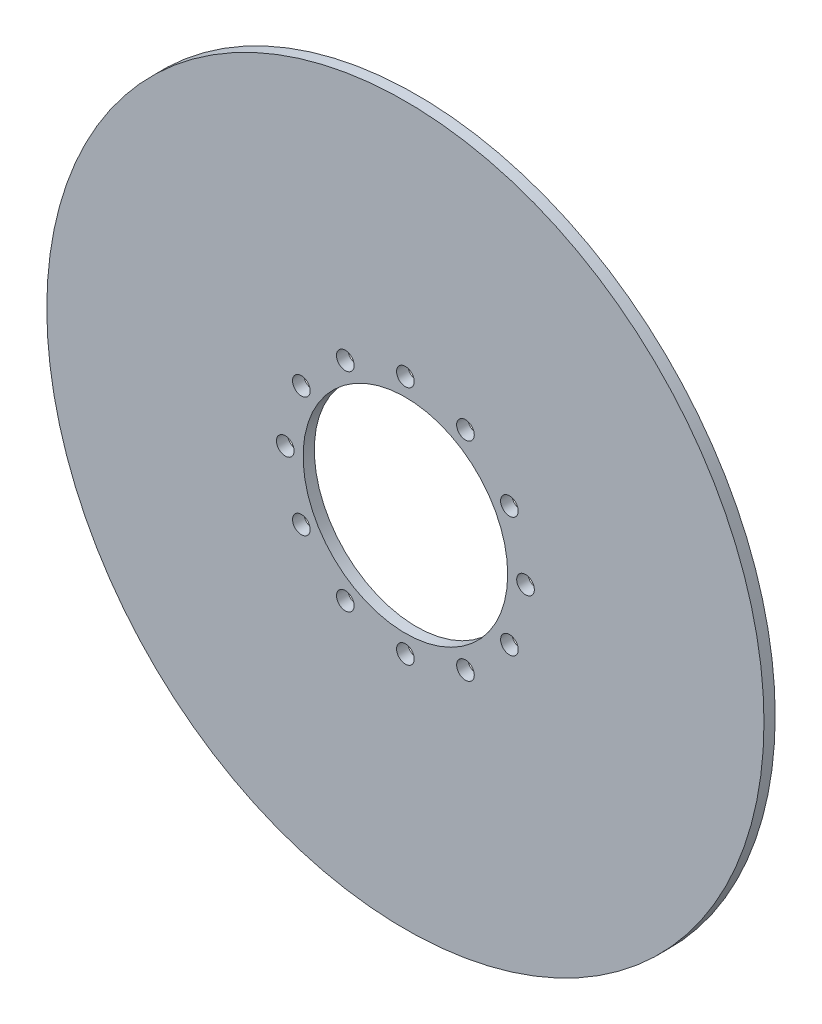
ISO-10303-21;
HEADER;
FILE_DESCRIPTION(('STEP AP214'),'2;1');
FILE_NAME('part.step','',(''),(''),'','','');
FILE_SCHEMA(('AUTOMOTIVE_DESIGN { 1 0 10303 214 1 1 1 1 }'));
ENDSEC;
DATA;
#1=APPLICATION_CONTEXT('core data for automotive mechanical design processes');
#2=APPLICATION_PROTOCOL_DEFINITION('international standard','automotive_design',2000,#1);
#3=PRODUCT_CONTEXT('',#1,'mechanical');
#4=PRODUCT('Part','Part','',(#3));
#5=PRODUCT_RELATED_PRODUCT_CATEGORY('part','',(#4));
#6=PRODUCT_DEFINITION_FORMATION('','',#4);
#7=PRODUCT_DEFINITION_CONTEXT('part definition',#1,'design');
#8=PRODUCT_DEFINITION('design','',#6,#7);
#9=PRODUCT_DEFINITION_SHAPE('','',#8);
#10=(LENGTH_UNIT() NAMED_UNIT(*) SI_UNIT(.MILLI.,.METRE.));
#11=(NAMED_UNIT(*) PLANE_ANGLE_UNIT() SI_UNIT($,.RADIAN.));
#12=(NAMED_UNIT(*) SI_UNIT($,.STERADIAN.) SOLID_ANGLE_UNIT());
#13=UNCERTAINTY_MEASURE_WITH_UNIT(LENGTH_MEASURE(1.E-05),#10,'distance_accuracy_value','');
#14=(GEOMETRIC_REPRESENTATION_CONTEXT(3) GLOBAL_UNCERTAINTY_ASSIGNED_CONTEXT((#13)) GLOBAL_UNIT_ASSIGNED_CONTEXT((#10,
#11,#12)) REPRESENTATION_CONTEXT('',''));
#15=CARTESIAN_POINT('',(0.,0.,0.));
#16=DIRECTION('',(0.,0.,1.));
#17=DIRECTION('',(1.,0.,0.));
#18=AXIS2_PLACEMENT_3D('',#15,#16,#17);
#19=CARTESIAN_POINT('',(0.,0.,3.175));
#20=DIRECTION('',(0.,0.,1.));
#21=DIRECTION('',(1.,0.,0.));
#22=AXIS2_PLACEMENT_3D('',#19,#20,#21);
#23=PLANE('',#22);
#24=CARTESIAN_POINT('',(-29.4448637286702,16.9999999999987,3.175));
#25=DIRECTION('',(0.,0.,1.));
#26=DIRECTION('',(1.,0.,0.));
#27=AXIS2_PLACEMENT_3D('',#24,#25,#26);
#28=CIRCLE('',#27,2.49698906987796);
#29=CARTESIAN_POINT('',(-26.9478746587923,16.9999999999987,3.175));
#30=VERTEX_POINT('',#29);
#31=EDGE_CURVE('E108',#30,#30,#28,.T.);
#32=ORIENTED_EDGE('',*,*,#31,.F.);
#33=EDGE_LOOP('',(#32));
#34=FACE_BOUND('',#33,.T.);
#35=CARTESIAN_POINT('',(-29.4448637286688,-17.0000000000013,3.175));
#36=DIRECTION('',(0.,0.,1.));
#37=DIRECTION('',(1.,0.,0.));
#38=AXIS2_PLACEMENT_3D('',#35,#36,#37);
#39=CIRCLE('',#38,2.49698906987796);
#40=CARTESIAN_POINT('',(-26.9478746587908,-17.0000000000013,3.175));
#41=VERTEX_POINT('',#40);
#42=EDGE_CURVE('E96',#41,#41,#39,.T.);
#43=ORIENTED_EDGE('',*,*,#42,.F.);
#44=EDGE_LOOP('',(#43));
#45=FACE_BOUND('',#44,.T.);
#46=CARTESIAN_POINT('',(2.86804195578331E-12,-34.,3.175));
#47=DIRECTION('',(0.,0.,1.));
#48=DIRECTION('',(1.,0.,0.));
#49=AXIS2_PLACEMENT_3D('',#46,#47,#48);
#50=CIRCLE('',#49,2.49698906987796);
#51=CARTESIAN_POINT('',(2.49698906988083,-34.,3.175));
#52=VERTEX_POINT('',#51);
#53=EDGE_CURVE('E84',#52,#52,#50,.T.);
#54=ORIENTED_EDGE('',*,*,#53,.F.);
#55=EDGE_LOOP('',(#54));
#56=FACE_BOUND('',#55,.T.);
#57=CARTESIAN_POINT('',(29.4448637286731,-16.9999999999988,3.175));
#58=DIRECTION('',(0.,0.,1.));
#59=DIRECTION('',(1.,0.,0.));
#60=AXIS2_PLACEMENT_3D('',#57,#58,#59);
#61=CIRCLE('',#60,2.49698906987769);
#62=CARTESIAN_POINT('',(31.9418527985508,-16.9999999999988,3.175));
#63=VERTEX_POINT('',#62);
#64=EDGE_CURVE('E72',#63,#63,#61,.T.);
#65=ORIENTED_EDGE('',*,*,#64,.F.);
#66=EDGE_LOOP('',(#65));
#67=FACE_BOUND('',#66,.T.);
#68=CARTESIAN_POINT('',(29.4448637286716,17.0000000000012,3.175));
#69=DIRECTION('',(0.,0.,1.));
#70=DIRECTION('',(1.,0.,0.));
#71=AXIS2_PLACEMENT_3D('',#68,#69,#70);
#72=CIRCLE('',#71,2.49698906987796);
#73=CARTESIAN_POINT('',(31.9418527985496,17.0000000000012,3.175));
#74=VERTEX_POINT('',#73);
#75=EDGE_CURVE('E60',#74,#74,#72,.T.);
#76=ORIENTED_EDGE('',*,*,#75,.F.);
#77=EDGE_LOOP('',(#76));
#78=FACE_BOUND('',#77,.T.);
#79=CARTESIAN_POINT('',(0.,34.,3.175));
#80=DIRECTION('',(0.,0.,1.));
#81=DIRECTION('',(1.,0.,0.));
#82=AXIS2_PLACEMENT_3D('',#79,#80,#81);
#83=CIRCLE('',#82,2.49698906987796);
#84=CARTESIAN_POINT('',(2.49698906987796,34.,3.175));
#85=VERTEX_POINT('',#84);
#86=EDGE_CURVE('E48',#85,#85,#83,.T.);
#87=ORIENTED_EDGE('',*,*,#86,.F.);
#88=EDGE_LOOP('',(#87));
#89=FACE_BOUND('',#88,.T.);
#90=CARTESIAN_POINT('',(0.,0.,3.175));
#91=DIRECTION('',(0.,0.,1.));
#92=DIRECTION('',(1.,0.,0.));
#93=AXIS2_PLACEMENT_3D('',#90,#91,#92);
#94=CIRCLE('',#93,101.5);
#95=CARTESIAN_POINT('',(101.5,0.,3.175));
#96=VERTEX_POINT('',#95);
#97=EDGE_CURVE('E10',#96,#96,#94,.T.);
#98=ORIENTED_EDGE('',*,*,#97,.T.);
#99=EDGE_LOOP('',(#98));
#100=FACE_BOUND('',#99,.T.);
#101=CARTESIAN_POINT('',(0.,0.,3.175));
#102=DIRECTION('',(0.,0.,1.));
#103=DIRECTION('',(1.,0.,0.));
#104=AXIS2_PLACEMENT_3D('',#101,#102,#103);
#105=CIRCLE('',#104,28.956);
#106=CARTESIAN_POINT('',(28.956,0.,3.175));
#107=VERTEX_POINT('',#106);
#108=EDGE_CURVE('E43',#107,#107,#105,.T.);
#109=ORIENTED_EDGE('',*,*,#108,.F.);
#110=EDGE_LOOP('',(#109));
#111=FACE_BOUND('',#110,.T.);
#112=CARTESIAN_POINT('',(17.0000000000002,29.4448637286716,3.175));
#113=DIRECTION('',(0.,0.,1.));
#114=DIRECTION('',(1.,0.,0.));
#115=AXIS2_PLACEMENT_3D('',#112,#113,#114);
#116=CIRCLE('',#115,2.49698906987796);
#117=CARTESIAN_POINT('',(19.4969890698782,29.4448637286716,3.175));
#118=VERTEX_POINT('',#117);
#119=EDGE_CURVE('E54',#118,#118,#116,.T.);
#120=ORIENTED_EDGE('',*,*,#119,.F.);
#121=EDGE_LOOP('',(#120));
#122=FACE_BOUND('',#121,.T.);
#123=CARTESIAN_POINT('',(34.0000000000014,1.43402097789165E-12,3.175));
#124=DIRECTION('',(0.,0.,1.));
#125=DIRECTION('',(1.,0.,0.));
#126=AXIS2_PLACEMENT_3D('',#123,#124,#125);
#127=CIRCLE('',#126,2.49698906987796);
#128=CARTESIAN_POINT('',(36.4969890698794,1.43402097789165E-12,3.175));
#129=VERTEX_POINT('',#128);
#130=EDGE_CURVE('E66',#129,#129,#127,.T.);
#131=ORIENTED_EDGE('',*,*,#130,.F.);
#132=EDGE_LOOP('',(#131));
#133=FACE_BOUND('',#132,.T.);
#134=CARTESIAN_POINT('',(17.0000000000027,-29.4448637286702,3.175));
#135=DIRECTION('',(0.,0.,1.));
#136=DIRECTION('',(1.,0.,0.));
#137=AXIS2_PLACEMENT_3D('',#134,#135,#136);
#138=CIRCLE('',#137,2.49698906987837);
#139=CARTESIAN_POINT('',(19.4969890698811,-29.4448637286702,3.175));
#140=VERTEX_POINT('',#139);
#141=EDGE_CURVE('E78',#140,#140,#138,.T.);
#142=ORIENTED_EDGE('',*,*,#141,.F.);
#143=EDGE_LOOP('',(#142));
#144=FACE_BOUND('',#143,.T.);
#145=CARTESIAN_POINT('',(-16.9999999999973,-29.4448637286716,3.175));
#146=DIRECTION('',(0.,0.,1.));
#147=DIRECTION('',(1.,0.,0.));
#148=AXIS2_PLACEMENT_3D('',#145,#146,#147);
#149=CIRCLE('',#148,2.49698906987796);
#150=CARTESIAN_POINT('',(-14.5030109301194,-29.4448637286716,3.175));
#151=VERTEX_POINT('',#150);
#152=EDGE_CURVE('E90',#151,#151,#149,.T.);
#153=ORIENTED_EDGE('',*,*,#152,.F.);
#154=EDGE_LOOP('',(#153));
#155=FACE_BOUND('',#154,.T.);
#156=CARTESIAN_POINT('',(-33.9999999999986,-1.43818477700875E-12,3.175));
#157=DIRECTION('',(0.,0.,1.));
#158=DIRECTION('',(1.,0.,0.));
#159=AXIS2_PLACEMENT_3D('',#156,#157,#158);
#160=CIRCLE('',#159,2.49698906987796);
#161=CARTESIAN_POINT('',(-31.5030109301206,-1.43818477700875E-12,3.175));
#162=VERTEX_POINT('',#161);
#163=EDGE_CURVE('E102',#162,#162,#160,.T.);
#164=ORIENTED_EDGE('',*,*,#163,.F.);
#165=EDGE_LOOP('',(#164));
#166=FACE_BOUND('',#165,.T.);
#167=CARTESIAN_POINT('',(-16.9999999999998,29.4448637286702,3.175));
#168=DIRECTION('',(0.,0.,1.));
#169=DIRECTION('',(1.,0.,0.));
#170=AXIS2_PLACEMENT_3D('',#167,#168,#169);
#171=CIRCLE('',#170,2.49698906987796);
#172=CARTESIAN_POINT('',(-14.5030109301219,29.4448637286702,3.175));
#173=VERTEX_POINT('',#172);
#174=EDGE_CURVE('E114',#173,#173,#171,.T.);
#175=ORIENTED_EDGE('',*,*,#174,.F.);
#176=EDGE_LOOP('',(#175));
#177=FACE_BOUND('',#176,.T.);
#178=ADVANCED_FACE('F32',(#34,#45,#56,#67,#78,#89,#100,#111,#122,#133,#144,#155,#166,#177),#23,.T.);
#179=CARTESIAN_POINT('',(0.,0.,0.));
#180=DIRECTION('',(0.,0.,1.));
#181=DIRECTION('',(1.,0.,0.));
#182=AXIS2_PLACEMENT_3D('',#179,#180,#181);
#183=PLANE('',#182);
#184=CARTESIAN_POINT('',(0.,0.,0.));
#185=DIRECTION('',(0.,0.,1.));
#186=DIRECTION('',(1.,0.,0.));
#187=AXIS2_PLACEMENT_3D('',#184,#185,#186);
#188=CIRCLE('',#187,101.5);
#189=CARTESIAN_POINT('',(101.5,0.,0.));
#190=VERTEX_POINT('',#189);
#191=EDGE_CURVE('E36',#190,#190,#188,.T.);
#192=ORIENTED_EDGE('',*,*,#191,.F.);
#193=EDGE_LOOP('',(#192));
#194=FACE_BOUND('',#193,.T.);
#195=CARTESIAN_POINT('',(0.,0.,0.));
#196=DIRECTION('',(0.,0.,1.));
#197=DIRECTION('',(1.,0.,0.));
#198=AXIS2_PLACEMENT_3D('',#195,#196,#197);
#199=CIRCLE('',#198,28.956);
#200=CARTESIAN_POINT('',(28.956,0.,0.));
#201=VERTEX_POINT('',#200);
#202=EDGE_CURVE('E45',#201,#201,#199,.T.);
#203=ORIENTED_EDGE('',*,*,#202,.T.);
#204=EDGE_LOOP('',(#203));
#205=FACE_BOUND('',#204,.T.);
#206=CARTESIAN_POINT('',(0.,34.,0.));
#207=DIRECTION('',(0.,0.,1.));
#208=DIRECTION('',(1.,0.,0.));
#209=AXIS2_PLACEMENT_3D('',#206,#207,#208);
#210=CIRCLE('',#209,2.49698906987796);
#211=CARTESIAN_POINT('',(2.49698906987796,34.,0.));
#212=VERTEX_POINT('',#211);
#213=EDGE_CURVE('E51',#212,#212,#210,.T.);
#214=ORIENTED_EDGE('',*,*,#213,.T.);
#215=EDGE_LOOP('',(#214));
#216=FACE_BOUND('',#215,.T.);
#217=CARTESIAN_POINT('',(17.0000000000002,29.4448637286716,0.));
#218=DIRECTION('',(0.,0.,1.));
#219=DIRECTION('',(1.,0.,0.));
#220=AXIS2_PLACEMENT_3D('',#217,#218,#219);
#221=CIRCLE('',#220,2.49698906987796);
#222=CARTESIAN_POINT('',(19.4969890698782,29.4448637286716,0.));
#223=VERTEX_POINT('',#222);
#224=EDGE_CURVE('E57',#223,#223,#221,.T.);
#225=ORIENTED_EDGE('',*,*,#224,.T.);
#226=EDGE_LOOP('',(#225));
#227=FACE_BOUND('',#226,.T.);
#228=CARTESIAN_POINT('',(29.4448637286716,17.0000000000012,0.));
#229=DIRECTION('',(0.,0.,1.));
#230=DIRECTION('',(1.,0.,0.));
#231=AXIS2_PLACEMENT_3D('',#228,#229,#230);
#232=CIRCLE('',#231,2.49698906987796);
#233=CARTESIAN_POINT('',(31.9418527985496,17.0000000000012,0.));
#234=VERTEX_POINT('',#233);
#235=EDGE_CURVE('E63',#234,#234,#232,.T.);
#236=ORIENTED_EDGE('',*,*,#235,.T.);
#237=EDGE_LOOP('',(#236));
#238=FACE_BOUND('',#237,.T.);
#239=CARTESIAN_POINT('',(34.0000000000014,1.43402097789165E-12,0.));
#240=DIRECTION('',(0.,0.,1.));
#241=DIRECTION('',(1.,0.,0.));
#242=AXIS2_PLACEMENT_3D('',#239,#240,#241);
#243=CIRCLE('',#242,2.49698906987796);
#244=CARTESIAN_POINT('',(36.4969890698794,1.43402097789165E-12,0.));
#245=VERTEX_POINT('',#244);
#246=EDGE_CURVE('E69',#245,#245,#243,.T.);
#247=ORIENTED_EDGE('',*,*,#246,.T.);
#248=EDGE_LOOP('',(#247));
#249=FACE_BOUND('',#248,.T.);
#250=CARTESIAN_POINT('',(29.4448637286731,-16.9999999999988,0.));
#251=DIRECTION('',(0.,0.,1.));
#252=DIRECTION('',(1.,0.,0.));
#253=AXIS2_PLACEMENT_3D('',#250,#251,#252);
#254=CIRCLE('',#253,2.49698906987769);
#255=CARTESIAN_POINT('',(31.9418527985508,-16.9999999999988,0.));
#256=VERTEX_POINT('',#255);
#257=EDGE_CURVE('E75',#256,#256,#254,.T.);
#258=ORIENTED_EDGE('',*,*,#257,.T.);
#259=EDGE_LOOP('',(#258));
#260=FACE_BOUND('',#259,.T.);
#261=CARTESIAN_POINT('',(17.0000000000027,-29.4448637286702,0.));
#262=DIRECTION('',(0.,0.,1.));
#263=DIRECTION('',(1.,0.,0.));
#264=AXIS2_PLACEMENT_3D('',#261,#262,#263);
#265=CIRCLE('',#264,2.49698906987837);
#266=CARTESIAN_POINT('',(19.4969890698811,-29.4448637286702,0.));
#267=VERTEX_POINT('',#266);
#268=EDGE_CURVE('E81',#267,#267,#265,.T.);
#269=ORIENTED_EDGE('',*,*,#268,.T.);
#270=EDGE_LOOP('',(#269));
#271=FACE_BOUND('',#270,.T.);
#272=CARTESIAN_POINT('',(2.86804195578331E-12,-34.,0.));
#273=DIRECTION('',(0.,0.,1.));
#274=DIRECTION('',(1.,0.,0.));
#275=AXIS2_PLACEMENT_3D('',#272,#273,#274);
#276=CIRCLE('',#275,2.49698906987796);
#277=CARTESIAN_POINT('',(2.49698906988083,-34.,0.));
#278=VERTEX_POINT('',#277);
#279=EDGE_CURVE('E87',#278,#278,#276,.T.);
#280=ORIENTED_EDGE('',*,*,#279,.T.);
#281=EDGE_LOOP('',(#280));
#282=FACE_BOUND('',#281,.T.);
#283=CARTESIAN_POINT('',(-16.9999999999973,-29.4448637286716,0.));
#284=DIRECTION('',(0.,0.,1.));
#285=DIRECTION('',(1.,0.,0.));
#286=AXIS2_PLACEMENT_3D('',#283,#284,#285);
#287=CIRCLE('',#286,2.49698906987796);
#288=CARTESIAN_POINT('',(-14.5030109301194,-29.4448637286716,0.));
#289=VERTEX_POINT('',#288);
#290=EDGE_CURVE('E93',#289,#289,#287,.T.);
#291=ORIENTED_EDGE('',*,*,#290,.T.);
#292=EDGE_LOOP('',(#291));
#293=FACE_BOUND('',#292,.T.);
#294=CARTESIAN_POINT('',(-29.4448637286688,-17.0000000000013,0.));
#295=DIRECTION('',(0.,0.,1.));
#296=DIRECTION('',(1.,0.,0.));
#297=AXIS2_PLACEMENT_3D('',#294,#295,#296);
#298=CIRCLE('',#297,2.49698906987796);
#299=CARTESIAN_POINT('',(-26.9478746587908,-17.0000000000013,0.));
#300=VERTEX_POINT('',#299);
#301=EDGE_CURVE('E99',#300,#300,#298,.T.);
#302=ORIENTED_EDGE('',*,*,#301,.T.);
#303=EDGE_LOOP('',(#302));
#304=FACE_BOUND('',#303,.T.);
#305=CARTESIAN_POINT('',(-33.9999999999986,-1.43818477700875E-12,0.));
#306=DIRECTION('',(0.,0.,1.));
#307=DIRECTION('',(1.,0.,0.));
#308=AXIS2_PLACEMENT_3D('',#305,#306,#307);
#309=CIRCLE('',#308,2.49698906987796);
#310=CARTESIAN_POINT('',(-31.5030109301206,-1.43818477700875E-12,0.));
#311=VERTEX_POINT('',#310);
#312=EDGE_CURVE('E105',#311,#311,#309,.T.);
#313=ORIENTED_EDGE('',*,*,#312,.T.);
#314=EDGE_LOOP('',(#313));
#315=FACE_BOUND('',#314,.T.);
#316=CARTESIAN_POINT('',(-29.4448637286702,16.9999999999987,0.));
#317=DIRECTION('',(0.,0.,1.));
#318=DIRECTION('',(1.,0.,0.));
#319=AXIS2_PLACEMENT_3D('',#316,#317,#318);
#320=CIRCLE('',#319,2.49698906987796);
#321=CARTESIAN_POINT('',(-26.9478746587923,16.9999999999987,0.));
#322=VERTEX_POINT('',#321);
#323=EDGE_CURVE('E111',#322,#322,#320,.T.);
#324=ORIENTED_EDGE('',*,*,#323,.T.);
#325=EDGE_LOOP('',(#324));
#326=FACE_BOUND('',#325,.T.);
#327=CARTESIAN_POINT('',(-16.9999999999998,29.4448637286702,0.));
#328=DIRECTION('',(0.,0.,1.));
#329=DIRECTION('',(1.,0.,0.));
#330=AXIS2_PLACEMENT_3D('',#327,#328,#329);
#331=CIRCLE('',#330,2.49698906987796);
#332=CARTESIAN_POINT('',(-14.5030109301219,29.4448637286702,0.));
#333=VERTEX_POINT('',#332);
#334=EDGE_CURVE('E117',#333,#333,#331,.T.);
#335=ORIENTED_EDGE('',*,*,#334,.T.);
#336=EDGE_LOOP('',(#335));
#337=FACE_BOUND('',#336,.T.);
#338=ADVANCED_FACE('F127',(#194,#205,#216,#227,#238,#249,#260,#271,#282,#293,#304,#315,#326,
#337),#183,.F.);
#339=CARTESIAN_POINT('',(0.,0.,3.175));
#340=DIRECTION('',(0.,0.,-1.));
#341=DIRECTION('',(-1.,0.,0.));
#342=AXIS2_PLACEMENT_3D('',#339,#340,#341);
#343=CYLINDRICAL_SURFACE('',#342,101.5);
#344=ORIENTED_EDGE('',*,*,#97,.F.);
#345=EDGE_LOOP('',(#344));
#346=FACE_BOUND('',#345,.T.);
#347=ORIENTED_EDGE('',*,*,#191,.T.);
#348=EDGE_LOOP('',(#347));
#349=FACE_BOUND('',#348,.T.);
#350=ADVANCED_FACE('F34',(#346,#349),#343,.T.);
#351=CARTESIAN_POINT('',(0.,0.,3.175));
#352=DIRECTION('',(0.,0.,-1.));
#353=DIRECTION('',(-1.,0.,0.));
#354=AXIS2_PLACEMENT_3D('',#351,#352,#353);
#355=CYLINDRICAL_SURFACE('',#354,28.956);
#356=ORIENTED_EDGE('',*,*,#108,.T.);
#357=EDGE_LOOP('',(#356));
#358=FACE_BOUND('',#357,.T.);
#359=ORIENTED_EDGE('',*,*,#202,.F.);
#360=EDGE_LOOP('',(#359));
#361=FACE_BOUND('',#360,.T.);
#362=ADVANCED_FACE('F137',(#358,#361),#355,.F.);
#363=CARTESIAN_POINT('',(0.,34.,3.175));
#364=DIRECTION('',(0.,0.,-1.));
#365=DIRECTION('',(-1.,0.,0.));
#366=AXIS2_PLACEMENT_3D('',#363,#364,#365);
#367=CYLINDRICAL_SURFACE('',#366,2.49698906987796);
#368=ORIENTED_EDGE('',*,*,#86,.T.);
#369=EDGE_LOOP('',(#368));
#370=FACE_BOUND('',#369,.T.);
#371=ORIENTED_EDGE('',*,*,#213,.F.);
#372=EDGE_LOOP('',(#371));
#373=FACE_BOUND('',#372,.T.);
#374=ADVANCED_FACE('F140',(#370,#373),#367,.F.);
#375=CARTESIAN_POINT('',(17.0000000000002,29.4448637286716,3.175));
#376=DIRECTION('',(0.,0.,-1.));
#377=DIRECTION('',(-1.,0.,0.));
#378=AXIS2_PLACEMENT_3D('',#375,#376,#377);
#379=CYLINDRICAL_SURFACE('',#378,2.49698906987796);
#380=ORIENTED_EDGE('',*,*,#119,.T.);
#381=EDGE_LOOP('',(#380));
#382=FACE_BOUND('',#381,.T.);
#383=ORIENTED_EDGE('',*,*,#224,.F.);
#384=EDGE_LOOP('',(#383));
#385=FACE_BOUND('',#384,.T.);
#386=ADVANCED_FACE('F144',(#382,#385),#379,.F.);
#387=CARTESIAN_POINT('',(29.4448637286716,17.0000000000012,3.175));
#388=DIRECTION('',(0.,0.,-1.));
#389=DIRECTION('',(-1.,0.,0.));
#390=AXIS2_PLACEMENT_3D('',#387,#388,#389);
#391=CYLINDRICAL_SURFACE('',#390,2.49698906987796);
#392=ORIENTED_EDGE('',*,*,#75,.T.);
#393=EDGE_LOOP('',(#392));
#394=FACE_BOUND('',#393,.T.);
#395=ORIENTED_EDGE('',*,*,#235,.F.);
#396=EDGE_LOOP('',(#395));
#397=FACE_BOUND('',#396,.T.);
#398=ADVANCED_FACE('F148',(#394,#397),#391,.F.);
#399=CARTESIAN_POINT('',(34.0000000000014,1.43402097789165E-12,3.175));
#400=DIRECTION('',(0.,0.,-1.));
#401=DIRECTION('',(-1.,0.,0.));
#402=AXIS2_PLACEMENT_3D('',#399,#400,#401);
#403=CYLINDRICAL_SURFACE('',#402,2.49698906987796);
#404=ORIENTED_EDGE('',*,*,#130,.T.);
#405=EDGE_LOOP('',(#404));
#406=FACE_BOUND('',#405,.T.);
#407=ORIENTED_EDGE('',*,*,#246,.F.);
#408=EDGE_LOOP('',(#407));
#409=FACE_BOUND('',#408,.T.);
#410=ADVANCED_FACE('F152',(#406,#409),#403,.F.);
#411=CARTESIAN_POINT('',(29.4448637286731,-16.9999999999988,3.175));
#412=DIRECTION('',(0.,0.,-1.));
#413=DIRECTION('',(-1.,0.,0.));
#414=AXIS2_PLACEMENT_3D('',#411,#412,#413);
#415=CYLINDRICAL_SURFACE('',#414,2.49698906987769);
#416=ORIENTED_EDGE('',*,*,#64,.T.);
#417=EDGE_LOOP('',(#416));
#418=FACE_BOUND('',#417,.T.);
#419=ORIENTED_EDGE('',*,*,#257,.F.);
#420=EDGE_LOOP('',(#419));
#421=FACE_BOUND('',#420,.T.);
#422=ADVANCED_FACE('F156',(#418,#421),#415,.F.);
#423=CARTESIAN_POINT('',(17.0000000000027,-29.4448637286702,3.175));
#424=DIRECTION('',(0.,0.,-1.));
#425=DIRECTION('',(-1.,0.,0.));
#426=AXIS2_PLACEMENT_3D('',#423,#424,#425);
#427=CYLINDRICAL_SURFACE('',#426,2.49698906987837);
#428=ORIENTED_EDGE('',*,*,#141,.T.);
#429=EDGE_LOOP('',(#428));
#430=FACE_BOUND('',#429,.T.);
#431=ORIENTED_EDGE('',*,*,#268,.F.);
#432=EDGE_LOOP('',(#431));
#433=FACE_BOUND('',#432,.T.);
#434=ADVANCED_FACE('F160',(#430,#433),#427,.F.);
#435=CARTESIAN_POINT('',(2.86804195578331E-12,-34.,3.175));
#436=DIRECTION('',(0.,0.,-1.));
#437=DIRECTION('',(-1.,0.,0.));
#438=AXIS2_PLACEMENT_3D('',#435,#436,#437);
#439=CYLINDRICAL_SURFACE('',#438,2.49698906987796);
#440=ORIENTED_EDGE('',*,*,#53,.T.);
#441=EDGE_LOOP('',(#440));
#442=FACE_BOUND('',#441,.T.);
#443=ORIENTED_EDGE('',*,*,#279,.F.);
#444=EDGE_LOOP('',(#443));
#445=FACE_BOUND('',#444,.T.);
#446=ADVANCED_FACE('F164',(#442,#445),#439,.F.);
#447=CARTESIAN_POINT('',(-16.9999999999973,-29.4448637286716,3.175));
#448=DIRECTION('',(0.,0.,-1.));
#449=DIRECTION('',(-1.,0.,0.));
#450=AXIS2_PLACEMENT_3D('',#447,#448,#449);
#451=CYLINDRICAL_SURFACE('',#450,2.49698906987796);
#452=ORIENTED_EDGE('',*,*,#152,.T.);
#453=EDGE_LOOP('',(#452));
#454=FACE_BOUND('',#453,.T.);
#455=ORIENTED_EDGE('',*,*,#290,.F.);
#456=EDGE_LOOP('',(#455));
#457=FACE_BOUND('',#456,.T.);
#458=ADVANCED_FACE('F168',(#454,#457),#451,.F.);
#459=CARTESIAN_POINT('',(-29.4448637286688,-17.0000000000013,3.175));
#460=DIRECTION('',(0.,0.,-1.));
#461=DIRECTION('',(-1.,0.,0.));
#462=AXIS2_PLACEMENT_3D('',#459,#460,#461);
#463=CYLINDRICAL_SURFACE('',#462,2.49698906987796);
#464=ORIENTED_EDGE('',*,*,#42,.T.);
#465=EDGE_LOOP('',(#464));
#466=FACE_BOUND('',#465,.T.);
#467=ORIENTED_EDGE('',*,*,#301,.F.);
#468=EDGE_LOOP('',(#467));
#469=FACE_BOUND('',#468,.T.);
#470=ADVANCED_FACE('F172',(#466,#469),#463,.F.);
#471=CARTESIAN_POINT('',(-33.9999999999986,-1.43818477700875E-12,3.175));
#472=DIRECTION('',(0.,0.,-1.));
#473=DIRECTION('',(-1.,0.,0.));
#474=AXIS2_PLACEMENT_3D('',#471,#472,#473);
#475=CYLINDRICAL_SURFACE('',#474,2.49698906987796);
#476=ORIENTED_EDGE('',*,*,#163,.T.);
#477=EDGE_LOOP('',(#476));
#478=FACE_BOUND('',#477,.T.);
#479=ORIENTED_EDGE('',*,*,#312,.F.);
#480=EDGE_LOOP('',(#479));
#481=FACE_BOUND('',#480,.T.);
#482=ADVANCED_FACE('F176',(#478,#481),#475,.F.);
#483=CARTESIAN_POINT('',(-29.4448637286702,16.9999999999987,3.175));
#484=DIRECTION('',(0.,0.,-1.));
#485=DIRECTION('',(-1.,0.,0.));
#486=AXIS2_PLACEMENT_3D('',#483,#484,#485);
#487=CYLINDRICAL_SURFACE('',#486,2.49698906987796);
#488=ORIENTED_EDGE('',*,*,#31,.T.);
#489=EDGE_LOOP('',(#488));
#490=FACE_BOUND('',#489,.T.);
#491=ORIENTED_EDGE('',*,*,#323,.F.);
#492=EDGE_LOOP('',(#491));
#493=FACE_BOUND('',#492,.T.);
#494=ADVANCED_FACE('F180',(#490,#493),#487,.F.);
#495=CARTESIAN_POINT('',(-16.9999999999998,29.4448637286702,3.175));
#496=DIRECTION('',(0.,0.,-1.));
#497=DIRECTION('',(-1.,0.,0.));
#498=AXIS2_PLACEMENT_3D('',#495,#496,#497);
#499=CYLINDRICAL_SURFACE('',#498,2.49698906987796);
#500=ORIENTED_EDGE('',*,*,#174,.T.);
#501=EDGE_LOOP('',(#500));
#502=FACE_BOUND('',#501,.T.);
#503=ORIENTED_EDGE('',*,*,#334,.F.);
#504=EDGE_LOOP('',(#503));
#505=FACE_BOUND('',#504,.T.);
#506=ADVANCED_FACE('F123',(#502,#505),#499,.F.);
#507=CLOSED_SHELL('',(#178,#338,#350,#362,#374,#386,#398,#410,#422,#434,#446,#458,#470,#482,
#494,#506));
#508=MANIFOLD_SOLID_BREP('B2',#507);
#509=ADVANCED_BREP_SHAPE_REPRESENTATION('',(#18,#508),#14);
#510=SHAPE_DEFINITION_REPRESENTATION(#9,#509);
ENDSEC;
END-ISO-10303-21;
